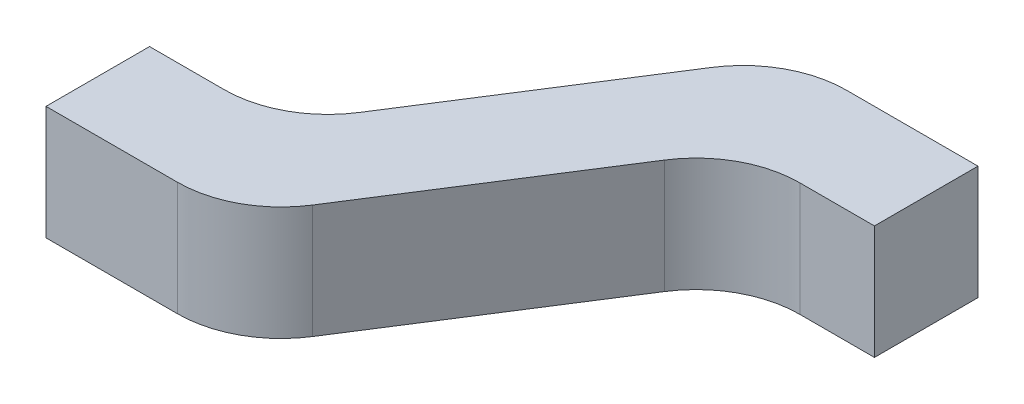
ISO-10303-21;
HEADER;
FILE_DESCRIPTION(('STEP AP214'),'2;1');
FILE_NAME('part.step','',(''),(''),'','','');
FILE_SCHEMA(('AUTOMOTIVE_DESIGN { 1 0 10303 214 1 1 1 1 }'));
ENDSEC;
DATA;
#1=APPLICATION_CONTEXT('core data for automotive mechanical design processes');
#2=APPLICATION_PROTOCOL_DEFINITION('international standard','automotive_design',2000,#1);
#3=PRODUCT_CONTEXT('',#1,'mechanical');
#4=PRODUCT('Part','Part','',(#3));
#5=PRODUCT_RELATED_PRODUCT_CATEGORY('part','',(#4));
#6=PRODUCT_DEFINITION_FORMATION('','',#4);
#7=PRODUCT_DEFINITION_CONTEXT('part definition',#1,'design');
#8=PRODUCT_DEFINITION('design','',#6,#7);
#9=PRODUCT_DEFINITION_SHAPE('','',#8);
#10=(LENGTH_UNIT() NAMED_UNIT(*) SI_UNIT(.MILLI.,.METRE.));
#11=(NAMED_UNIT(*) PLANE_ANGLE_UNIT() SI_UNIT($,.RADIAN.));
#12=(NAMED_UNIT(*) SI_UNIT($,.STERADIAN.) SOLID_ANGLE_UNIT());
#13=UNCERTAINTY_MEASURE_WITH_UNIT(LENGTH_MEASURE(1.E-05),#10,'distance_accuracy_value','');
#14=(GEOMETRIC_REPRESENTATION_CONTEXT(3) GLOBAL_UNCERTAINTY_ASSIGNED_CONTEXT((#13)) GLOBAL_UNIT_ASSIGNED_CONTEXT((#10,
#11,#12)) REPRESENTATION_CONTEXT('',''));
#15=CARTESIAN_POINT('',(0.,0.,0.));
#16=DIRECTION('',(0.,0.,1.));
#17=DIRECTION('',(1.,0.,0.));
#18=AXIS2_PLACEMENT_3D('',#15,#16,#17);
#19=CARTESIAN_POINT('',(0.,0.11,0.1));
#20=DIRECTION('',(1.,0.,0.));
#21=DIRECTION('',(0.,0.,-1.));
#22=AXIS2_PLACEMENT_3D('',#19,#20,#21);
#23=PLANE('',#22);
#24=DIRECTION('',(0.,0.,1.));
#25=VECTOR('',#24,1.);
#26=CARTESIAN_POINT('',(0.,-0.11,0.1));
#27=LINE('',#26,#25);
#28=CARTESIAN_POINT('',(0.,-0.11,-0.1));
#29=VERTEX_POINT('',#28);
#30=CARTESIAN_POINT('',(0.,-0.11,0.1));
#31=VERTEX_POINT('',#30);
#32=EDGE_CURVE('E153',#29,#31,#27,.T.);
#33=ORIENTED_EDGE('',*,*,#32,.T.);
#34=DIRECTION('',(0.,-1.,0.));
#35=VECTOR('',#34,1.);
#36=CARTESIAN_POINT('',(0.,0.11,0.1));
#37=LINE('',#36,#35);
#38=CARTESIAN_POINT('',(0.,0.11,0.1));
#39=VERTEX_POINT('',#38);
#40=EDGE_CURVE('E11',#39,#31,#37,.T.);
#41=ORIENTED_EDGE('',*,*,#40,.F.);
#42=DIRECTION('',(0.,0.,1.));
#43=VECTOR('',#42,1.);
#44=CARTESIAN_POINT('',(0.,0.11,0.1));
#45=LINE('',#44,#43);
#46=CARTESIAN_POINT('',(0.,0.11,-0.1));
#47=VERTEX_POINT('',#46);
#48=EDGE_CURVE('E175',#47,#39,#45,.T.);
#49=ORIENTED_EDGE('',*,*,#48,.F.);
#50=DIRECTION('',(0.,-1.,0.));
#51=VECTOR('',#50,1.);
#52=CARTESIAN_POINT('',(0.,0.11,-0.1));
#53=LINE('',#52,#51);
#54=EDGE_CURVE('E149',#47,#29,#53,.T.);
#55=ORIENTED_EDGE('',*,*,#54,.T.);
#56=EDGE_LOOP('',(#33,#41,#49,#55));
#57=FACE_BOUND('',#56,.T.);
#58=ADVANCED_FACE('F33',(#57),#23,.F.);
#59=CARTESIAN_POINT('',(0.,0.11,0.1));
#60=DIRECTION('',(0.,0.,-1.));
#61=DIRECTION('',(-1.,0.,0.));
#62=AXIS2_PLACEMENT_3D('',#59,#60,#61);
#63=PLANE('',#62);
#64=DIRECTION('',(1.,0.,0.));
#65=VECTOR('',#64,1.);
#66=CARTESIAN_POINT('',(0.,-0.11,0.1));
#67=LINE('',#66,#65);
#68=CARTESIAN_POINT('',(0.253926549083776,-0.11,0.1));
#69=VERTEX_POINT('',#68);
#70=EDGE_CURVE('E156',#31,#69,#67,.T.);
#71=ORIENTED_EDGE('',*,*,#70,.T.);
#72=DIRECTION('',(0.,-1.,0.));
#73=VECTOR('',#72,1.);
#74=CARTESIAN_POINT('',(0.253926549083776,0.11,0.1));
#75=LINE('',#74,#73);
#76=CARTESIAN_POINT('',(0.253926549083776,0.11,0.1));
#77=VERTEX_POINT('',#76);
#78=EDGE_CURVE('E41',#77,#69,#75,.T.);
#79=ORIENTED_EDGE('',*,*,#78,.F.);
#80=DIRECTION('',(1.,0.,0.));
#81=VECTOR('',#80,1.);
#82=CARTESIAN_POINT('',(0.,0.11,0.1));
#83=LINE('',#82,#81);
#84=EDGE_CURVE('E104',#39,#77,#83,.T.);
#85=ORIENTED_EDGE('',*,*,#84,.F.);
#86=ORIENTED_EDGE('',*,*,#40,.T.);
#87=EDGE_LOOP('',(#71,#79,#85,#86));
#88=FACE_BOUND('',#87,.T.);
#89=ADVANCED_FACE('F253',(#88),#63,.F.);
#90=CARTESIAN_POINT('',(0.253926549083776,0.11,-0.1));
#91=DIRECTION('',(0.,-1.,0.));
#92=DIRECTION('',(0.,0.,-1.));
#93=AXIS2_PLACEMENT_3D('',#90,#91,#92);
#94=CYLINDRICAL_SURFACE('',#93,0.2);
#95=CARTESIAN_POINT('',(0.253926549083776,-0.11,-0.1));
#96=DIRECTION('',(0.,1.,0.));
#97=DIRECTION('',(0.,0.,1.));
#98=AXIS2_PLACEMENT_3D('',#95,#96,#97);
#99=CIRCLE('',#98,0.2);
#100=CARTESIAN_POINT('',(0.422577576671992,-0.11,0.00750270179599688));
#101=VERTEX_POINT('',#100);
#102=EDGE_CURVE('E158',#69,#101,#99,.T.);
#103=ORIENTED_EDGE('',*,*,#102,.T.);
#104=DIRECTION('',(0.,-1.,0.));
#105=VECTOR('',#104,1.);
#106=CARTESIAN_POINT('',(0.422577576671992,0.11,0.00750270179599688));
#107=LINE('',#106,#105);
#108=CARTESIAN_POINT('',(0.422577576671992,0.11,0.00750270179599688));
#109=VERTEX_POINT('',#108);
#110=EDGE_CURVE('E194',#109,#101,#107,.T.);
#111=ORIENTED_EDGE('',*,*,#110,.F.);
#112=CARTESIAN_POINT('',(0.253926549083776,0.11,-0.1));
#113=DIRECTION('',(0.,1.,0.));
#114=DIRECTION('',(0.,0.,1.));
#115=AXIS2_PLACEMENT_3D('',#112,#113,#114);
#116=CIRCLE('',#115,0.2);
#117=EDGE_CURVE('E202',#77,#109,#116,.T.);
#118=ORIENTED_EDGE('',*,*,#117,.F.);
#119=ORIENTED_EDGE('',*,*,#78,.T.);
#120=EDGE_LOOP('',(#103,#111,#118,#119));
#121=FACE_BOUND('',#120,.T.);
#122=ADVANCED_FACE('F200',(#121),#94,.T.);
#123=CARTESIAN_POINT('',(0.422577576671992,0.11,0.00750270179599687));
#124=DIRECTION('',(-0.843255137941077,0.,-0.537513508979985));
#125=DIRECTION('',(-0.537513508979985,0.,0.843255137941077));
#126=AXIS2_PLACEMENT_3D('',#123,#124,#125);
#127=PLANE('',#126);
#128=DIRECTION('',(0.537513508979985,0.,-0.843255137941077));
#129=VECTOR('',#128,1.);
#130=CARTESIAN_POINT('',(0.422577576671992,-0.11,0.00750270179599687));
#131=LINE('',#130,#129);
#132=CARTESIAN_POINT('',(0.687113184809578,-0.11,-0.407502701795997));
#133=VERTEX_POINT('',#132);
#134=EDGE_CURVE('E160',#101,#133,#131,.T.);
#135=ORIENTED_EDGE('',*,*,#134,.T.);
#136=DIRECTION('',(0.,-1.,0.));
#137=VECTOR('',#136,1.);
#138=CARTESIAN_POINT('',(0.687113184809578,0.11,-0.407502701795997));
#139=LINE('',#138,#137);
#140=CARTESIAN_POINT('',(0.687113184809578,0.11,-0.407502701795997));
#141=VERTEX_POINT('',#140);
#142=EDGE_CURVE('E191',#141,#133,#139,.T.);
#143=ORIENTED_EDGE('',*,*,#142,.F.);
#144=DIRECTION('',(0.537513508979985,0.,-0.843255137941077));
#145=VECTOR('',#144,1.);
#146=CARTESIAN_POINT('',(0.422577576671992,0.11,0.00750270179599687));
#147=LINE('',#146,#145);
#148=EDGE_CURVE('E220',#109,#141,#147,.T.);
#149=ORIENTED_EDGE('',*,*,#148,.F.);
#150=ORIENTED_EDGE('',*,*,#110,.T.);
#151=EDGE_LOOP('',(#135,#143,#149,#150));
#152=FACE_BOUND('',#151,.T.);
#153=ADVANCED_FACE('F211',(#152),#127,.F.);
#154=CARTESIAN_POINT('',(0.855764212397794,0.11,-0.3));
#155=DIRECTION('',(0.,-1.,0.));
#156=DIRECTION('',(0.,0.,-1.));
#157=AXIS2_PLACEMENT_3D('',#154,#155,#156);
#158=CYLINDRICAL_SURFACE('',#157,0.2);
#159=CARTESIAN_POINT('',(0.855764212397794,-0.11,-0.3));
#160=DIRECTION('',(0.,-1.,0.));
#161=DIRECTION('',(0.,0.,-1.));
#162=AXIS2_PLACEMENT_3D('',#159,#160,#161);
#163=CIRCLE('',#162,0.2);
#164=CARTESIAN_POINT('',(0.855764212397794,-0.11,-0.5));
#165=VERTEX_POINT('',#164);
#166=EDGE_CURVE('E162',#133,#165,#163,.T.);
#167=ORIENTED_EDGE('',*,*,#166,.T.);
#168=DIRECTION('',(0.,-1.,0.));
#169=VECTOR('',#168,1.);
#170=CARTESIAN_POINT('',(0.855764212397794,0.11,-0.5));
#171=LINE('',#170,#169);
#172=CARTESIAN_POINT('',(0.855764212397794,0.11,-0.5));
#173=VERTEX_POINT('',#172);
#174=EDGE_CURVE('E188',#173,#165,#171,.T.);
#175=ORIENTED_EDGE('',*,*,#174,.F.);
#176=CARTESIAN_POINT('',(0.855764212397794,0.11,-0.3));
#177=DIRECTION('',(0.,-1.,0.));
#178=DIRECTION('',(0.,0.,-1.));
#179=AXIS2_PLACEMENT_3D('',#176,#177,#178);
#180=CIRCLE('',#179,0.2);
#181=EDGE_CURVE('E217',#141,#173,#180,.T.);
#182=ORIENTED_EDGE('',*,*,#181,.F.);
#183=ORIENTED_EDGE('',*,*,#142,.T.);
#184=EDGE_LOOP('',(#167,#175,#182,#183));
#185=FACE_BOUND('',#184,.T.);
#186=ADVANCED_FACE('F215',(#185),#158,.F.);
#187=CARTESIAN_POINT('',(0.855764212397794,0.11,-0.5));
#188=DIRECTION('',(0.,0.,-1.));
#189=DIRECTION('',(-1.,0.,0.));
#190=AXIS2_PLACEMENT_3D('',#187,#188,#189);
#191=PLANE('',#190);
#192=DIRECTION('',(1.,0.,0.));
#193=VECTOR('',#192,1.);
#194=CARTESIAN_POINT('',(0.855764212397794,-0.11,-0.5));
#195=LINE('',#194,#193);
#196=CARTESIAN_POINT('',(1.,-0.11,-0.5));
#197=VERTEX_POINT('',#196);
#198=EDGE_CURVE('E164',#165,#197,#195,.T.);
#199=ORIENTED_EDGE('',*,*,#198,.T.);
#200=DIRECTION('',(0.,-1.,0.));
#201=VECTOR('',#200,1.);
#202=CARTESIAN_POINT('',(1.,0.11,-0.5));
#203=LINE('',#202,#201);
#204=CARTESIAN_POINT('',(1.,0.11,-0.5));
#205=VERTEX_POINT('',#204);
#206=EDGE_CURVE('E185',#205,#197,#203,.T.);
#207=ORIENTED_EDGE('',*,*,#206,.F.);
#208=DIRECTION('',(1.,0.,0.));
#209=VECTOR('',#208,1.);
#210=CARTESIAN_POINT('',(0.855764212397794,0.11,-0.5));
#211=LINE('',#210,#209);
#212=EDGE_CURVE('E219',#173,#205,#211,.T.);
#213=ORIENTED_EDGE('',*,*,#212,.F.);
#214=ORIENTED_EDGE('',*,*,#174,.T.);
#215=EDGE_LOOP('',(#199,#207,#213,#214));
#216=FACE_BOUND('',#215,.T.);
#217=ADVANCED_FACE('F266',(#216),#191,.F.);
#218=CARTESIAN_POINT('',(1.,0.11,-0.5));
#219=DIRECTION('',(-1.,0.,0.));
#220=DIRECTION('',(0.,0.,1.));
#221=AXIS2_PLACEMENT_3D('',#218,#219,#220);
#222=PLANE('',#221);
#223=DIRECTION('',(0.,0.,-1.));
#224=VECTOR('',#223,1.);
#225=CARTESIAN_POINT('',(1.,-0.11,-0.5));
#226=LINE('',#225,#224);
#227=CARTESIAN_POINT('',(1.,-0.11,-0.7));
#228=VERTEX_POINT('',#227);
#229=EDGE_CURVE('E166',#197,#228,#226,.T.);
#230=ORIENTED_EDGE('',*,*,#229,.T.);
#231=DIRECTION('',(0.,-1.,0.));
#232=VECTOR('',#231,1.);
#233=CARTESIAN_POINT('',(1.,0.11,-0.7));
#234=LINE('',#233,#232);
#235=CARTESIAN_POINT('',(1.,0.11,-0.7));
#236=VERTEX_POINT('',#235);
#237=EDGE_CURVE('E182',#236,#228,#234,.T.);
#238=ORIENTED_EDGE('',*,*,#237,.F.);
#239=DIRECTION('',(0.,0.,-1.));
#240=VECTOR('',#239,1.);
#241=CARTESIAN_POINT('',(1.,0.11,-0.5));
#242=LINE('',#241,#240);
#243=EDGE_CURVE('E222',#205,#236,#242,.T.);
#244=ORIENTED_EDGE('',*,*,#243,.F.);
#245=ORIENTED_EDGE('',*,*,#206,.T.);
#246=EDGE_LOOP('',(#230,#238,#244,#245));
#247=FACE_BOUND('',#246,.T.);
#248=ADVANCED_FACE('F269',(#247),#222,.F.);
#249=CARTESIAN_POINT('',(0.746073450916224,0.11,-0.7));
#250=DIRECTION('',(0.,0.,1.));
#251=DIRECTION('',(1.,0.,0.));
#252=AXIS2_PLACEMENT_3D('',#249,#250,#251);
#253=PLANE('',#252);
#254=DIRECTION('',(-1.,0.,0.));
#255=VECTOR('',#254,1.);
#256=CARTESIAN_POINT('',(0.746073450916224,-0.11,-0.7));
#257=LINE('',#256,#255);
#258=CARTESIAN_POINT('',(0.746073450916224,-0.11,-0.7));
#259=VERTEX_POINT('',#258);
#260=EDGE_CURVE('E168',#228,#259,#257,.T.);
#261=ORIENTED_EDGE('',*,*,#260,.T.);
#262=DIRECTION('',(0.,-1.,0.));
#263=VECTOR('',#262,1.);
#264=CARTESIAN_POINT('',(0.746073450916224,0.11,-0.7));
#265=LINE('',#264,#263);
#266=CARTESIAN_POINT('',(0.746073450916224,0.11,-0.7));
#267=VERTEX_POINT('',#266);
#268=EDGE_CURVE('E179',#267,#259,#265,.T.);
#269=ORIENTED_EDGE('',*,*,#268,.F.);
#270=DIRECTION('',(-1.,0.,0.));
#271=VECTOR('',#270,1.);
#272=CARTESIAN_POINT('',(0.746073450916224,0.11,-0.7));
#273=LINE('',#272,#271);
#274=EDGE_CURVE('E228',#236,#267,#273,.T.);
#275=ORIENTED_EDGE('',*,*,#274,.F.);
#276=ORIENTED_EDGE('',*,*,#237,.T.);
#277=EDGE_LOOP('',(#261,#269,#275,#276));
#278=FACE_BOUND('',#277,.T.);
#279=ADVANCED_FACE('F234',(#278),#253,.F.);
#280=CARTESIAN_POINT('',(0.746073450916224,0.11,-0.5));
#281=DIRECTION('',(0.,-1.,0.));
#282=DIRECTION('',(0.,0.,-1.));
#283=AXIS2_PLACEMENT_3D('',#280,#281,#282);
#284=CYLINDRICAL_SURFACE('',#283,0.2);
#285=CARTESIAN_POINT('',(0.746073450916224,-0.11,-0.5));
#286=DIRECTION('',(0.,1.,0.));
#287=DIRECTION('',(0.,0.,-1.));
#288=AXIS2_PLACEMENT_3D('',#285,#286,#287);
#289=CIRCLE('',#288,0.2);
#290=CARTESIAN_POINT('',(0.577422423328008,-0.11,-0.607502701795997));
#291=VERTEX_POINT('',#290);
#292=EDGE_CURVE('E170',#259,#291,#289,.T.);
#293=ORIENTED_EDGE('',*,*,#292,.T.);
#294=DIRECTION('',(0.,-1.,0.));
#295=VECTOR('',#294,1.);
#296=CARTESIAN_POINT('',(0.577422423328008,0.11,-0.607502701795997));
#297=LINE('',#296,#295);
#298=CARTESIAN_POINT('',(0.577422423328008,0.11,-0.607502701795997));
#299=VERTEX_POINT('',#298);
#300=EDGE_CURVE('E144',#299,#291,#297,.T.);
#301=ORIENTED_EDGE('',*,*,#300,.F.);
#302=CARTESIAN_POINT('',(0.746073450916224,0.11,-0.5));
#303=DIRECTION('',(0.,1.,0.));
#304=DIRECTION('',(0.,0.,-1.));
#305=AXIS2_PLACEMENT_3D('',#302,#303,#304);
#306=CIRCLE('',#305,0.2);
#307=EDGE_CURVE('E135',#267,#299,#306,.T.);
#308=ORIENTED_EDGE('',*,*,#307,.F.);
#309=ORIENTED_EDGE('',*,*,#268,.T.);
#310=EDGE_LOOP('',(#293,#301,#308,#309));
#311=FACE_BOUND('',#310,.T.);
#312=ADVANCED_FACE('F238',(#311),#284,.T.);
#313=CARTESIAN_POINT('',(0.312886815190422,0.11,-0.192497298204003));
#314=DIRECTION('',(0.843255137941077,0.,0.537513508979985));
#315=DIRECTION('',(0.537513508979984,0.,-0.843255137941077));
#316=AXIS2_PLACEMENT_3D('',#313,#314,#315);
#317=PLANE('',#316);
#318=DIRECTION('',(-0.537513508979984,0.,0.843255137941077));
#319=VECTOR('',#318,1.);
#320=CARTESIAN_POINT('',(0.312886815190422,-0.11,-0.192497298204003));
#321=LINE('',#320,#319);
#322=CARTESIAN_POINT('',(0.312886815190422,-0.11,-0.192497298204003));
#323=VERTEX_POINT('',#322);
#324=EDGE_CURVE('E143',#291,#323,#321,.T.);
#325=ORIENTED_EDGE('',*,*,#324,.T.);
#326=DIRECTION('',(0.,-1.,0.));
#327=VECTOR('',#326,1.);
#328=CARTESIAN_POINT('',(0.312886815190422,0.11,-0.192497298204003));
#329=LINE('',#328,#327);
#330=CARTESIAN_POINT('',(0.312886815190422,0.11,-0.192497298204003));
#331=VERTEX_POINT('',#330);
#332=EDGE_CURVE('E140',#331,#323,#329,.T.);
#333=ORIENTED_EDGE('',*,*,#332,.F.);
#334=DIRECTION('',(-0.537513508979984,0.,0.843255137941077));
#335=VECTOR('',#334,1.);
#336=CARTESIAN_POINT('',(0.312886815190422,0.11,-0.192497298204003));
#337=LINE('',#336,#335);
#338=EDGE_CURVE('E129',#299,#331,#337,.T.);
#339=ORIENTED_EDGE('',*,*,#338,.F.);
#340=ORIENTED_EDGE('',*,*,#300,.T.);
#341=EDGE_LOOP('',(#325,#333,#339,#340));
#342=FACE_BOUND('',#341,.T.);
#343=ADVANCED_FACE('F141',(#342),#317,.F.);
#344=CARTESIAN_POINT('',(0.144235787602206,0.11,-0.3));
#345=DIRECTION('',(0.,-1.,0.));
#346=DIRECTION('',(0.,0.,-1.));
#347=AXIS2_PLACEMENT_3D('',#344,#345,#346);
#348=CYLINDRICAL_SURFACE('',#347,0.2);
#349=CARTESIAN_POINT('',(0.144235787602206,-0.11,-0.3));
#350=DIRECTION('',(0.,-1.,0.));
#351=DIRECTION('',(0.,0.,1.));
#352=AXIS2_PLACEMENT_3D('',#349,#350,#351);
#353=CIRCLE('',#352,0.2);
#354=CARTESIAN_POINT('',(0.144235787602206,-0.11,-0.1));
#355=VERTEX_POINT('',#354);
#356=EDGE_CURVE('E90',#323,#355,#353,.T.);
#357=ORIENTED_EDGE('',*,*,#356,.T.);
#358=DIRECTION('',(0.,-1.,0.));
#359=VECTOR('',#358,1.);
#360=CARTESIAN_POINT('',(0.144235787602206,0.11,-0.1));
#361=LINE('',#360,#359);
#362=CARTESIAN_POINT('',(0.144235787602206,0.11,-0.1));
#363=VERTEX_POINT('',#362);
#364=EDGE_CURVE('E145',#363,#355,#361,.T.);
#365=ORIENTED_EDGE('',*,*,#364,.F.);
#366=CARTESIAN_POINT('',(0.144235787602206,0.11,-0.3));
#367=DIRECTION('',(0.,-1.,0.));
#368=DIRECTION('',(0.,0.,1.));
#369=AXIS2_PLACEMENT_3D('',#366,#367,#368);
#370=CIRCLE('',#369,0.2);
#371=EDGE_CURVE('E133',#331,#363,#370,.T.);
#372=ORIENTED_EDGE('',*,*,#371,.F.);
#373=ORIENTED_EDGE('',*,*,#332,.T.);
#374=EDGE_LOOP('',(#357,#365,#372,#373));
#375=FACE_BOUND('',#374,.T.);
#376=ADVANCED_FACE('F147',(#375),#348,.F.);
#377=CARTESIAN_POINT('',(0.,0.11,-0.1));
#378=DIRECTION('',(0.,0.,1.));
#379=DIRECTION('',(1.,0.,0.));
#380=AXIS2_PLACEMENT_3D('',#377,#378,#379);
#381=PLANE('',#380);
#382=DIRECTION('',(-1.,0.,0.));
#383=VECTOR('',#382,1.);
#384=CARTESIAN_POINT('',(0.,-0.11,-0.1));
#385=LINE('',#384,#383);
#386=EDGE_CURVE('E96',#355,#29,#385,.T.);
#387=ORIENTED_EDGE('',*,*,#386,.T.);
#388=ORIENTED_EDGE('',*,*,#54,.F.);
#389=DIRECTION('',(-1.,0.,0.));
#390=VECTOR('',#389,1.);
#391=CARTESIAN_POINT('',(0.,0.11,-0.1));
#392=LINE('',#391,#390);
#393=EDGE_CURVE('E49',#363,#47,#392,.T.);
#394=ORIENTED_EDGE('',*,*,#393,.F.);
#395=ORIENTED_EDGE('',*,*,#364,.T.);
#396=EDGE_LOOP('',(#387,#388,#394,#395));
#397=FACE_BOUND('',#396,.T.);
#398=ADVANCED_FACE('F242',(#397),#381,.F.);
#399=CARTESIAN_POINT('',(0.144235787602206,0.11,-0.3));
#400=DIRECTION('',(0.,1.,0.));
#401=DIRECTION('',(0.,0.,1.));
#402=AXIS2_PLACEMENT_3D('',#399,#400,#401);
#403=PLANE('',#402);
#404=ORIENTED_EDGE('',*,*,#48,.T.);
#405=ORIENTED_EDGE('',*,*,#84,.T.);
#406=ORIENTED_EDGE('',*,*,#117,.T.);
#407=ORIENTED_EDGE('',*,*,#148,.T.);
#408=ORIENTED_EDGE('',*,*,#181,.T.);
#409=ORIENTED_EDGE('',*,*,#212,.T.);
#410=ORIENTED_EDGE('',*,*,#243,.T.);
#411=ORIENTED_EDGE('',*,*,#274,.T.);
#412=ORIENTED_EDGE('',*,*,#307,.T.);
#413=ORIENTED_EDGE('',*,*,#338,.T.);
#414=ORIENTED_EDGE('',*,*,#371,.T.);
#415=ORIENTED_EDGE('',*,*,#393,.T.);
#416=EDGE_LOOP('',(#404,#405,#406,#407,#408,#409,#410,#411,#412,#413,#414,#415));
#417=FACE_BOUND('',#416,.T.);
#418=ADVANCED_FACE('F131',(#417),#403,.T.);
#419=CARTESIAN_POINT('',(0.144235787602206,-0.11,-0.3));
#420=DIRECTION('',(0.,1.,0.));
#421=DIRECTION('',(0.,0.,1.));
#422=AXIS2_PLACEMENT_3D('',#419,#420,#421);
#423=PLANE('',#422);
#424=ORIENTED_EDGE('',*,*,#32,.F.);
#425=ORIENTED_EDGE('',*,*,#386,.F.);
#426=ORIENTED_EDGE('',*,*,#356,.F.);
#427=ORIENTED_EDGE('',*,*,#324,.F.);
#428=ORIENTED_EDGE('',*,*,#292,.F.);
#429=ORIENTED_EDGE('',*,*,#260,.F.);
#430=ORIENTED_EDGE('',*,*,#229,.F.);
#431=ORIENTED_EDGE('',*,*,#198,.F.);
#432=ORIENTED_EDGE('',*,*,#166,.F.);
#433=ORIENTED_EDGE('',*,*,#134,.F.);
#434=ORIENTED_EDGE('',*,*,#102,.F.);
#435=ORIENTED_EDGE('',*,*,#70,.F.);
#436=EDGE_LOOP('',(#424,#425,#426,#427,#428,#429,#430,#431,#432,#433,#434,#435));
#437=FACE_BOUND('',#436,.T.);
#438=ADVANCED_FACE('F206',(#437),#423,.F.);
#439=CLOSED_SHELL('',(#58,#89,#122,#153,#186,#217,#248,#279,#312,#343,#376,#398,#418,#438));
#440=MANIFOLD_SOLID_BREP('B2',#439);
#441=ADVANCED_BREP_SHAPE_REPRESENTATION('',(#18,#440),#14);
#442=SHAPE_DEFINITION_REPRESENTATION(#9,#441);
ENDSEC;
END-ISO-10303-21;
